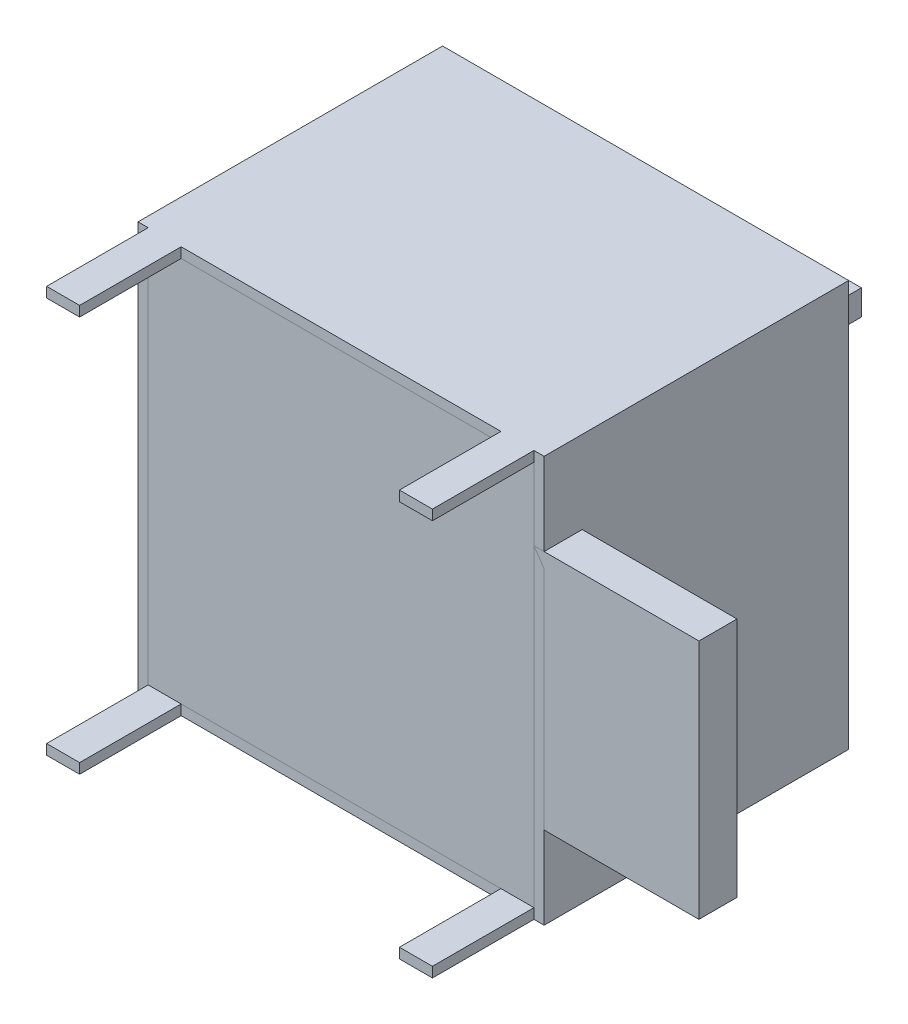
ISO-10303-21;
HEADER;
FILE_DESCRIPTION(('STEP AP214'),'2;1');
FILE_NAME('part.step','',(''),(''),'','','');
FILE_SCHEMA(('AUTOMOTIVE_DESIGN { 1 0 10303 214 1 1 1 1 }'));
ENDSEC;
DATA;
#1=APPLICATION_CONTEXT('core data for automotive mechanical design processes');
#2=APPLICATION_PROTOCOL_DEFINITION('international standard','automotive_design',2000,#1);
#3=PRODUCT_CONTEXT('',#1,'mechanical');
#4=PRODUCT('Part','Part','',(#3));
#5=PRODUCT_RELATED_PRODUCT_CATEGORY('part','',(#4));
#6=PRODUCT_DEFINITION_FORMATION('','',#4);
#7=PRODUCT_DEFINITION_CONTEXT('part definition',#1,'design');
#8=PRODUCT_DEFINITION('design','',#6,#7);
#9=PRODUCT_DEFINITION_SHAPE('','',#8);
#10=(LENGTH_UNIT() NAMED_UNIT(*) SI_UNIT(.MILLI.,.METRE.));
#11=(NAMED_UNIT(*) PLANE_ANGLE_UNIT() SI_UNIT($,.RADIAN.));
#12=(NAMED_UNIT(*) SI_UNIT($,.STERADIAN.) SOLID_ANGLE_UNIT());
#13=UNCERTAINTY_MEASURE_WITH_UNIT(LENGTH_MEASURE(1.E-05),#10,'distance_accuracy_value','');
#14=(GEOMETRIC_REPRESENTATION_CONTEXT(3) GLOBAL_UNCERTAINTY_ASSIGNED_CONTEXT((#13)) GLOBAL_UNIT_ASSIGNED_CONTEXT((#10,
#11,#12)) REPRESENTATION_CONTEXT('',''));
#15=CARTESIAN_POINT('',(0.,0.,0.));
#16=DIRECTION('',(0.,0.,1.));
#17=DIRECTION('',(1.,0.,0.));
#18=AXIS2_PLACEMENT_3D('',#15,#16,#17);
#19=CARTESIAN_POINT('',(0.4,15.6,10.5));
#20=DIRECTION('',(-1.,0.,0.));
#21=DIRECTION('',(0.,0.,1.));
#22=AXIS2_PLACEMENT_3D('',#19,#20,#21);
#23=PLANE('',#22);
#24=DIRECTION('',(0.,-1.,0.));
#25=VECTOR('',#24,1.);
#26=CARTESIAN_POINT('',(0.4,15.6,12.));
#27=LINE('',#26,#25);
#28=CARTESIAN_POINT('',(0.4,15.6,12.));
#29=VERTEX_POINT('',#28);
#30=CARTESIAN_POINT('',(0.4,0.399999999999999,12.));
#31=VERTEX_POINT('',#30);
#32=EDGE_CURVE('E141',#29,#31,#27,.T.);
#33=ORIENTED_EDGE('',*,*,#32,.F.);
#34=DIRECTION('',(0.,0.,1.));
#35=VECTOR('',#34,1.);
#36=CARTESIAN_POINT('',(0.4,15.6,10.5));
#37=LINE('',#36,#35);
#38=CARTESIAN_POINT('',(0.4,15.6,10.5));
#39=VERTEX_POINT('',#38);
#40=EDGE_CURVE('E12',#39,#29,#37,.T.);
#41=ORIENTED_EDGE('',*,*,#40,.F.);
#42=DIRECTION('',(0.,-1.,0.));
#43=VECTOR('',#42,1.);
#44=CARTESIAN_POINT('',(0.4,15.6,10.5));
#45=LINE('',#44,#43);
#46=CARTESIAN_POINT('',(0.4,0.399999999999999,10.5));
#47=VERTEX_POINT('',#46);
#48=EDGE_CURVE('E161',#39,#47,#45,.T.);
#49=ORIENTED_EDGE('',*,*,#48,.T.);
#50=DIRECTION('',(0.,0.,1.));
#51=VECTOR('',#50,1.);
#52=CARTESIAN_POINT('',(0.4,0.399999999999999,10.5));
#53=LINE('',#52,#51);
#54=EDGE_CURVE('E47',#47,#31,#53,.T.);
#55=ORIENTED_EDGE('',*,*,#54,.T.);
#56=EDGE_LOOP('',(#33,#41,#49,#55));
#57=FACE_BOUND('',#56,.T.);
#58=ADVANCED_FACE('F44',(#57),#23,.T.);
#59=CARTESIAN_POINT('',(0.4,15.6,10.5));
#60=DIRECTION('',(0.,1.,0.));
#61=DIRECTION('',(0.,0.,1.));
#62=AXIS2_PLACEMENT_3D('',#59,#60,#61);
#63=PLANE('',#62);
#64=DIRECTION('',(-1.,0.,0.));
#65=VECTOR('',#64,1.);
#66=CARTESIAN_POINT('',(0.4,15.6,12.));
#67=LINE('',#66,#65);
#68=CARTESIAN_POINT('',(15.6,15.6,12.));
#69=VERTEX_POINT('',#68);
#70=EDGE_CURVE('E159',#69,#29,#67,.T.);
#71=ORIENTED_EDGE('',*,*,#70,.F.);
#72=DIRECTION('',(0.,0.,1.));
#73=VECTOR('',#72,1.);
#74=CARTESIAN_POINT('',(15.6,15.6,10.5));
#75=LINE('',#74,#73);
#76=CARTESIAN_POINT('',(15.6,15.6,10.5));
#77=VERTEX_POINT('',#76);
#78=EDGE_CURVE('E53',#77,#69,#75,.T.);
#79=ORIENTED_EDGE('',*,*,#78,.F.);
#80=DIRECTION('',(-1.,0.,0.));
#81=VECTOR('',#80,1.);
#82=CARTESIAN_POINT('',(0.4,15.6,10.5));
#83=LINE('',#82,#81);
#84=EDGE_CURVE('E131',#77,#39,#83,.T.);
#85=ORIENTED_EDGE('',*,*,#84,.T.);
#86=ORIENTED_EDGE('',*,*,#40,.T.);
#87=EDGE_LOOP('',(#71,#79,#85,#86));
#88=FACE_BOUND('',#87,.T.);
#89=ADVANCED_FACE('F173',(#88),#63,.T.);
#90=CARTESIAN_POINT('',(15.6,15.6,10.5));
#91=DIRECTION('',(1.,0.,0.));
#92=DIRECTION('',(0.,1.,0.));
#93=AXIS2_PLACEMENT_3D('',#90,#91,#92);
#94=PLANE('',#93);
#95=DIRECTION('',(0.,1.,0.));
#96=VECTOR('',#95,1.);
#97=CARTESIAN_POINT('',(15.6,15.6,12.));
#98=LINE('',#97,#96);
#99=CARTESIAN_POINT('',(15.6,12.75,12.));
#100=VERTEX_POINT('',#99);
#101=EDGE_CURVE('E118',#100,#69,#98,.T.);
#102=ORIENTED_EDGE('',*,*,#101,.F.);
#103=DIRECTION('',(0.,0.,1.));
#104=VECTOR('',#103,1.);
#105=CARTESIAN_POINT('',(15.6,12.75,10.5));
#106=LINE('',#105,#104);
#107=CARTESIAN_POINT('',(15.6,12.75,10.5));
#108=VERTEX_POINT('',#107);
#109=EDGE_CURVE('E113',#108,#100,#106,.T.);
#110=ORIENTED_EDGE('',*,*,#109,.F.);
#111=DIRECTION('',(0.,1.,0.));
#112=VECTOR('',#111,1.);
#113=CARTESIAN_POINT('',(15.6,15.6,10.5));
#114=LINE('',#113,#112);
#115=EDGE_CURVE('E116',#108,#77,#114,.T.);
#116=ORIENTED_EDGE('',*,*,#115,.T.);
#117=ORIENTED_EDGE('',*,*,#78,.T.);
#118=EDGE_LOOP('',(#102,#110,#116,#117));
#119=FACE_BOUND('',#118,.T.);
#120=ADVANCED_FACE('F115',(#119),#94,.T.);
#121=CARTESIAN_POINT('',(15.6,12.75,10.5));
#122=DIRECTION('',(0.,1.,0.));
#123=DIRECTION('',(0.,0.,1.));
#124=AXIS2_PLACEMENT_3D('',#121,#122,#123);
#125=PLANE('',#124);
#126=DIRECTION('',(-1.,0.,0.));
#127=VECTOR('',#126,1.);
#128=CARTESIAN_POINT('',(15.6,12.75,12.));
#129=LINE('',#128,#127);
#130=CARTESIAN_POINT('',(22.1,12.75,12.));
#131=VERTEX_POINT('',#130);
#132=EDGE_CURVE('E156',#131,#100,#129,.T.);
#133=ORIENTED_EDGE('',*,*,#132,.F.);
#134=DIRECTION('',(0.,0.,1.));
#135=VECTOR('',#134,1.);
#136=CARTESIAN_POINT('',(22.1,12.75,10.5));
#137=LINE('',#136,#135);
#138=CARTESIAN_POINT('',(22.1,12.75,10.5));
#139=VERTEX_POINT('',#138);
#140=EDGE_CURVE('E123',#139,#131,#137,.T.);
#141=ORIENTED_EDGE('',*,*,#140,.F.);
#142=DIRECTION('',(-1.,0.,0.));
#143=VECTOR('',#142,1.);
#144=CARTESIAN_POINT('',(15.6,12.75,10.5));
#145=LINE('',#144,#143);
#146=EDGE_CURVE('E129',#139,#108,#145,.T.);
#147=ORIENTED_EDGE('',*,*,#146,.T.);
#148=ORIENTED_EDGE('',*,*,#109,.T.);
#149=EDGE_LOOP('',(#133,#141,#147,#148));
#150=FACE_BOUND('',#149,.T.);
#151=ADVANCED_FACE('F133',(#150),#125,.T.);
#152=CARTESIAN_POINT('',(22.1,12.75,10.5));
#153=DIRECTION('',(1.,0.,0.));
#154=DIRECTION('',(0.,0.,-1.));
#155=AXIS2_PLACEMENT_3D('',#152,#153,#154);
#156=PLANE('',#155);
#157=DIRECTION('',(0.,1.,0.));
#158=VECTOR('',#157,1.);
#159=CARTESIAN_POINT('',(22.1,12.75,12.));
#160=LINE('',#159,#158);
#161=CARTESIAN_POINT('',(22.1,3.25,12.));
#162=VERTEX_POINT('',#161);
#163=EDGE_CURVE('E153',#162,#131,#160,.T.);
#164=ORIENTED_EDGE('',*,*,#163,.F.);
#165=DIRECTION('',(0.,0.,1.));
#166=VECTOR('',#165,1.);
#167=CARTESIAN_POINT('',(22.1,3.25,10.5));
#168=LINE('',#167,#166);
#169=CARTESIAN_POINT('',(22.1,3.25,10.5));
#170=VERTEX_POINT('',#169);
#171=EDGE_CURVE('E165',#170,#162,#168,.T.);
#172=ORIENTED_EDGE('',*,*,#171,.F.);
#173=DIRECTION('',(0.,1.,0.));
#174=VECTOR('',#173,1.);
#175=CARTESIAN_POINT('',(22.1,12.75,10.5));
#176=LINE('',#175,#174);
#177=EDGE_CURVE('E134',#170,#139,#176,.T.);
#178=ORIENTED_EDGE('',*,*,#177,.T.);
#179=ORIENTED_EDGE('',*,*,#140,.T.);
#180=EDGE_LOOP('',(#164,#172,#178,#179));
#181=FACE_BOUND('',#180,.T.);
#182=ADVANCED_FACE('F186',(#181),#156,.T.);
#183=CARTESIAN_POINT('',(15.6,3.25,10.5));
#184=DIRECTION('',(0.,-1.,0.));
#185=DIRECTION('',(0.,0.,-1.));
#186=AXIS2_PLACEMENT_3D('',#183,#184,#185);
#187=PLANE('',#186);
#188=DIRECTION('',(1.,0.,0.));
#189=VECTOR('',#188,1.);
#190=CARTESIAN_POINT('',(15.6,3.25,12.));
#191=LINE('',#190,#189);
#192=CARTESIAN_POINT('',(15.6,3.25,12.));
#193=VERTEX_POINT('',#192);
#194=EDGE_CURVE('E150',#193,#162,#191,.T.);
#195=ORIENTED_EDGE('',*,*,#194,.F.);
#196=DIRECTION('',(0.,0.,1.));
#197=VECTOR('',#196,1.);
#198=CARTESIAN_POINT('',(15.6,3.25,10.5));
#199=LINE('',#198,#197);
#200=CARTESIAN_POINT('',(15.6,3.25,10.5));
#201=VERTEX_POINT('',#200);
#202=EDGE_CURVE('E167',#201,#193,#199,.T.);
#203=ORIENTED_EDGE('',*,*,#202,.F.);
#204=DIRECTION('',(1.,0.,0.));
#205=VECTOR('',#204,1.);
#206=CARTESIAN_POINT('',(15.6,3.25,10.5));
#207=LINE('',#206,#205);
#208=EDGE_CURVE('E136',#201,#170,#207,.T.);
#209=ORIENTED_EDGE('',*,*,#208,.T.);
#210=ORIENTED_EDGE('',*,*,#171,.T.);
#211=EDGE_LOOP('',(#195,#203,#209,#210));
#212=FACE_BOUND('',#211,.T.);
#213=ADVANCED_FACE('F189',(#212),#187,.T.);
#214=CARTESIAN_POINT('',(15.6,3.25,10.5));
#215=DIRECTION('',(1.,0.,0.));
#216=DIRECTION('',(0.,1.,0.));
#217=AXIS2_PLACEMENT_3D('',#214,#215,#216);
#218=PLANE('',#217);
#219=DIRECTION('',(0.,1.,0.));
#220=VECTOR('',#219,1.);
#221=CARTESIAN_POINT('',(15.6,3.25,12.));
#222=LINE('',#221,#220);
#223=CARTESIAN_POINT('',(15.6,0.399999999999999,12.));
#224=VERTEX_POINT('',#223);
#225=EDGE_CURVE('E147',#224,#193,#222,.T.);
#226=ORIENTED_EDGE('',*,*,#225,.F.);
#227=DIRECTION('',(0.,0.,1.));
#228=VECTOR('',#227,1.);
#229=CARTESIAN_POINT('',(15.6,0.399999999999999,10.5));
#230=LINE('',#229,#228);
#231=CARTESIAN_POINT('',(15.6,0.399999999999999,10.5));
#232=VERTEX_POINT('',#231);
#233=EDGE_CURVE('E168',#232,#224,#230,.T.);
#234=ORIENTED_EDGE('',*,*,#233,.F.);
#235=DIRECTION('',(0.,1.,0.));
#236=VECTOR('',#235,1.);
#237=CARTESIAN_POINT('',(15.6,3.25,10.5));
#238=LINE('',#237,#236);
#239=EDGE_CURVE('E264',#232,#201,#238,.T.);
#240=ORIENTED_EDGE('',*,*,#239,.T.);
#241=ORIENTED_EDGE('',*,*,#202,.T.);
#242=EDGE_LOOP('',(#226,#234,#240,#241));
#243=FACE_BOUND('',#242,.T.);
#244=ADVANCED_FACE('F193',(#243),#218,.T.);
#245=CARTESIAN_POINT('',(0.4,0.399999999999999,10.5));
#246=DIRECTION('',(0.,-1.,0.));
#247=DIRECTION('',(0.,0.,-1.));
#248=AXIS2_PLACEMENT_3D('',#245,#246,#247);
#249=PLANE('',#248);
#250=DIRECTION('',(1.,0.,0.));
#251=VECTOR('',#250,1.);
#252=CARTESIAN_POINT('',(0.4,0.399999999999999,12.));
#253=LINE('',#252,#251);
#254=EDGE_CURVE('E144',#31,#224,#253,.T.);
#255=ORIENTED_EDGE('',*,*,#254,.F.);
#256=ORIENTED_EDGE('',*,*,#54,.F.);
#257=DIRECTION('',(1.,0.,0.));
#258=VECTOR('',#257,1.);
#259=CARTESIAN_POINT('',(0.4,0.399999999999999,10.5));
#260=LINE('',#259,#258);
#261=EDGE_CURVE('E265',#47,#232,#260,.T.);
#262=ORIENTED_EDGE('',*,*,#261,.T.);
#263=ORIENTED_EDGE('',*,*,#233,.T.);
#264=EDGE_LOOP('',(#255,#256,#262,#263));
#265=FACE_BOUND('',#264,.T.);
#266=ADVANCED_FACE('F170',(#265),#249,.T.);
#267=CARTESIAN_POINT('',(0.,0.,10.5));
#268=DIRECTION('',(0.,0.,1.));
#269=DIRECTION('',(1.,0.,0.));
#270=AXIS2_PLACEMENT_3D('',#267,#268,#269);
#271=PLANE('',#270);
#272=ORIENTED_EDGE('',*,*,#48,.F.);
#273=ORIENTED_EDGE('',*,*,#84,.F.);
#274=ORIENTED_EDGE('',*,*,#115,.F.);
#275=ORIENTED_EDGE('',*,*,#146,.F.);
#276=ORIENTED_EDGE('',*,*,#177,.F.);
#277=ORIENTED_EDGE('',*,*,#208,.F.);
#278=ORIENTED_EDGE('',*,*,#239,.F.);
#279=ORIENTED_EDGE('',*,*,#261,.F.);
#280=EDGE_LOOP('',(#272,#273,#274,#275,#276,#277,#278,#279));
#281=FACE_BOUND('',#280,.T.);
#282=ADVANCED_FACE('F127',(#281),#271,.F.);
#283=CARTESIAN_POINT('',(0.,0.,12.));
#284=DIRECTION('',(0.,0.,1.));
#285=DIRECTION('',(1.,0.,0.));
#286=AXIS2_PLACEMENT_3D('',#283,#284,#285);
#287=PLANE('',#286);
#288=ORIENTED_EDGE('',*,*,#32,.T.);
#289=ORIENTED_EDGE('',*,*,#254,.T.);
#290=ORIENTED_EDGE('',*,*,#225,.T.);
#291=ORIENTED_EDGE('',*,*,#194,.T.);
#292=ORIENTED_EDGE('',*,*,#163,.T.);
#293=ORIENTED_EDGE('',*,*,#132,.T.);
#294=ORIENTED_EDGE('',*,*,#101,.T.);
#295=ORIENTED_EDGE('',*,*,#70,.T.);
#296=EDGE_LOOP('',(#288,#289,#290,#291,#292,#293,#294,#295));
#297=FACE_BOUND('',#296,.T.);
#298=ADVANCED_FACE('F172',(#297),#287,.T.);
#299=CLOSED_SHELL('',(#58,#89,#120,#151,#182,#213,#244,#266,#282,#298));
#300=MANIFOLD_SOLID_BREP('B2',#299);
#301=CARTESIAN_POINT('',(0.,0.,0.));
#302=DIRECTION('',(0.,0.,-1.));
#303=DIRECTION('',(-1.,0.,0.));
#304=AXIS2_PLACEMENT_3D('',#301,#302,#303);
#305=PLANE('',#304);
#306=DIRECTION('',(0.,-1.,0.));
#307=VECTOR('',#306,1.);
#308=CARTESIAN_POINT('',(0.,0.,0.));
#309=LINE('',#308,#307);
#310=CARTESIAN_POINT('',(0.,16.,0.));
#311=VERTEX_POINT('',#310);
#312=CARTESIAN_POINT('',(0.,0.,0.));
#313=VERTEX_POINT('',#312);
#314=EDGE_CURVE('E611',#311,#313,#309,.T.);
#315=ORIENTED_EDGE('',*,*,#314,.F.);
#316=DIRECTION('',(-1.,0.,0.));
#317=VECTOR('',#316,1.);
#318=CARTESIAN_POINT('',(0.,16.,0.));
#319=LINE('',#318,#317);
#320=CARTESIAN_POINT('',(16.,16.,0.));
#321=VERTEX_POINT('',#320);
#322=EDGE_CURVE('E603',#321,#311,#319,.T.);
#323=ORIENTED_EDGE('',*,*,#322,.F.);
#324=DIRECTION('',(0.,1.,0.));
#325=VECTOR('',#324,1.);
#326=CARTESIAN_POINT('',(16.,0.,0.));
#327=LINE('',#326,#325);
#328=CARTESIAN_POINT('',(16.,0.,0.));
#329=VERTEX_POINT('',#328);
#330=EDGE_CURVE('E627',#329,#321,#327,.T.);
#331=ORIENTED_EDGE('',*,*,#330,.F.);
#332=DIRECTION('',(1.,0.,0.));
#333=VECTOR('',#332,1.);
#334=CARTESIAN_POINT('',(0.,0.,0.));
#335=LINE('',#334,#333);
#336=EDGE_CURVE('E628',#313,#329,#335,.T.);
#337=ORIENTED_EDGE('',*,*,#336,.F.);
#338=EDGE_LOOP('',(#315,#323,#331,#337));
#339=FACE_BOUND('',#338,.T.);
#340=DIRECTION('',(1.,0.,0.));
#341=VECTOR('',#340,1.);
#342=CARTESIAN_POINT('',(9.,8.5,0.));
#343=LINE('',#342,#341);
#344=CARTESIAN_POINT('',(7.,8.5,0.));
#345=VERTEX_POINT('',#344);
#346=CARTESIAN_POINT('',(9.,8.5,0.));
#347=VERTEX_POINT('',#346);
#348=EDGE_CURVE('E1030',#345,#347,#343,.T.);
#349=ORIENTED_EDGE('',*,*,#348,.F.);
#350=DIRECTION('',(0.,1.,0.));
#351=VECTOR('',#350,1.);
#352=CARTESIAN_POINT('',(7.,8.5,0.));
#353=LINE('',#352,#351);
#354=CARTESIAN_POINT('',(7.,7.5,0.));
#355=VERTEX_POINT('',#354);
#356=EDGE_CURVE('E470',#355,#345,#353,.T.);
#357=ORIENTED_EDGE('',*,*,#356,.F.);
#358=DIRECTION('',(-1.,0.,0.));
#359=VECTOR('',#358,1.);
#360=CARTESIAN_POINT('',(9.,7.5,0.));
#361=LINE('',#360,#359);
#362=CARTESIAN_POINT('',(9.,7.5,0.));
#363=VERTEX_POINT('',#362);
#364=EDGE_CURVE('E466',#363,#355,#361,.T.);
#365=ORIENTED_EDGE('',*,*,#364,.F.);
#366=DIRECTION('',(0.,-1.,0.));
#367=VECTOR('',#366,1.);
#368=CARTESIAN_POINT('',(9.,8.5,0.));
#369=LINE('',#368,#367);
#370=EDGE_CURVE('E1027',#347,#363,#369,.T.);
#371=ORIENTED_EDGE('',*,*,#370,.F.);
#372=EDGE_LOOP('',(#349,#357,#365,#371));
#373=FACE_BOUND('',#372,.T.);
#374=ADVANCED_FACE('F271',(#339,#373),#305,.T.);
#375=CARTESIAN_POINT('',(0.,0.,12.));
#376=DIRECTION('',(0.,0.,-1.));
#377=DIRECTION('',(-1.,0.,0.));
#378=AXIS2_PLACEMENT_3D('',#375,#376,#377);
#379=PLANE('',#378);
#380=DIRECTION('',(1.,0.,0.));
#381=VECTOR('',#380,1.);
#382=CARTESIAN_POINT('',(0.,0.,12.));
#383=LINE('',#382,#381);
#384=CARTESIAN_POINT('',(0.,0.,12.));
#385=VERTEX_POINT('',#384);
#386=CARTESIAN_POINT('',(0.4,0.,12.));
#387=VERTEX_POINT('',#386);
#388=EDGE_CURVE('E604',#385,#387,#383,.T.);
#389=ORIENTED_EDGE('',*,*,#388,.T.);
#390=DIRECTION('',(0.,1.,0.));
#391=VECTOR('',#390,1.);
#392=CARTESIAN_POINT('',(0.4,0.399999999999999,12.));
#393=LINE('',#392,#391);
#394=CARTESIAN_POINT('',(0.4,0.399999999999999,12.));
#395=VERTEX_POINT('',#394);
#396=EDGE_CURVE('E472',#387,#395,#393,.T.);
#397=ORIENTED_EDGE('',*,*,#396,.T.);
#398=DIRECTION('',(0.,-1.,0.));
#399=VECTOR('',#398,1.);
#400=CARTESIAN_POINT('',(0.4,0.,12.));
#401=LINE('',#400,#399);
#402=CARTESIAN_POINT('',(0.4,15.6,12.));
#403=VERTEX_POINT('',#402);
#404=EDGE_CURVE('E659',#403,#395,#401,.T.);
#405=ORIENTED_EDGE('',*,*,#404,.F.);
#406=DIRECTION('',(0.,-1.,0.));
#407=VECTOR('',#406,1.);
#408=CARTESIAN_POINT('',(0.4,15.6,12.));
#409=LINE('',#408,#407);
#410=CARTESIAN_POINT('',(0.4,16.,12.));
#411=VERTEX_POINT('',#410);
#412=EDGE_CURVE('E552',#411,#403,#409,.T.);
#413=ORIENTED_EDGE('',*,*,#412,.F.);
#414=DIRECTION('',(-1.,0.,0.));
#415=VECTOR('',#414,1.);
#416=CARTESIAN_POINT('',(0.,16.,12.));
#417=LINE('',#416,#415);
#418=CARTESIAN_POINT('',(0.,16.,12.));
#419=VERTEX_POINT('',#418);
#420=EDGE_CURVE('E572',#411,#419,#417,.T.);
#421=ORIENTED_EDGE('',*,*,#420,.T.);
#422=DIRECTION('',(0.,-1.,0.));
#423=VECTOR('',#422,1.);
#424=CARTESIAN_POINT('',(0.,0.,12.));
#425=LINE('',#424,#423);
#426=EDGE_CURVE('E599',#419,#385,#425,.T.);
#427=ORIENTED_EDGE('',*,*,#426,.T.);
#428=EDGE_LOOP('',(#389,#397,#405,#413,#421,#427));
#429=FACE_BOUND('',#428,.T.);
#430=ADVANCED_FACE('F715',(#429),#379,.F.);
#431=DIRECTION('',(0.,1.,0.));
#432=VECTOR('',#431,1.);
#433=CARTESIAN_POINT('',(15.6,0.399999999999999,12.));
#434=LINE('',#433,#432);
#435=CARTESIAN_POINT('',(15.6,0.,12.));
#436=VERTEX_POINT('',#435);
#437=CARTESIAN_POINT('',(15.6,0.4,12.));
#438=VERTEX_POINT('',#437);
#439=EDGE_CURVE('E500',#436,#438,#434,.T.);
#440=ORIENTED_EDGE('',*,*,#439,.F.);
#441=CARTESIAN_POINT('',(16.,0.,12.));
#442=VERTEX_POINT('',#441);
#443=EDGE_CURVE('E602',#436,#442,#383,.T.);
#444=ORIENTED_EDGE('',*,*,#443,.T.);
#445=DIRECTION('',(0.,1.,0.));
#446=VECTOR('',#445,1.);
#447=CARTESIAN_POINT('',(16.,0.,12.));
#448=LINE('',#447,#446);
#449=CARTESIAN_POINT('',(16.,16.,12.));
#450=VERTEX_POINT('',#449);
#451=EDGE_CURVE('E607',#442,#450,#448,.T.);
#452=ORIENTED_EDGE('',*,*,#451,.T.);
#453=CARTESIAN_POINT('',(15.6,16.,12.));
#454=VERTEX_POINT('',#453);
#455=EDGE_CURVE('E615',#450,#454,#417,.T.);
#456=ORIENTED_EDGE('',*,*,#455,.T.);
#457=DIRECTION('',(0.,-1.,0.));
#458=VECTOR('',#457,1.);
#459=CARTESIAN_POINT('',(15.6,15.6,12.));
#460=LINE('',#459,#458);
#461=CARTESIAN_POINT('',(15.6,15.6,12.));
#462=VERTEX_POINT('',#461);
#463=EDGE_CURVE('E525',#454,#462,#460,.T.);
#464=ORIENTED_EDGE('',*,*,#463,.T.);
#465=DIRECTION('',(0.,1.,0.));
#466=VECTOR('',#465,1.);
#467=CARTESIAN_POINT('',(15.6,0.,12.));
#468=LINE('',#467,#466);
#469=EDGE_CURVE('E594',#438,#462,#468,.T.);
#470=ORIENTED_EDGE('',*,*,#469,.F.);
#471=EDGE_LOOP('',(#440,#444,#452,#456,#464,#470));
#472=FACE_BOUND('',#471,.T.);
#473=ADVANCED_FACE('F674',(#472),#379,.F.);
#474=DIRECTION('',(1.,0.,0.));
#475=VECTOR('',#474,1.);
#476=CARTESIAN_POINT('',(0.,0.4,12.));
#477=LINE('',#476,#475);
#478=CARTESIAN_POINT('',(1.7,0.4,12.));
#479=VERTEX_POINT('',#478);
#480=CARTESIAN_POINT('',(14.3,0.399999999999999,12.));
#481=VERTEX_POINT('',#480);
#482=EDGE_CURVE('E660',#479,#481,#477,.T.);
#483=ORIENTED_EDGE('',*,*,#482,.F.);
#484=DIRECTION('',(0.,-1.,0.));
#485=VECTOR('',#484,1.);
#486=CARTESIAN_POINT('',(1.7,0.399999999999999,12.));
#487=LINE('',#486,#485);
#488=CARTESIAN_POINT('',(1.7,0.,12.));
#489=VERTEX_POINT('',#488);
#490=EDGE_CURVE('E297',#479,#489,#487,.T.);
#491=ORIENTED_EDGE('',*,*,#490,.T.);
#492=CARTESIAN_POINT('',(14.3,0.,12.));
#493=VERTEX_POINT('',#492);
#494=EDGE_CURVE('E608',#489,#493,#383,.T.);
#495=ORIENTED_EDGE('',*,*,#494,.T.);
#496=DIRECTION('',(0.,-1.,0.));
#497=VECTOR('',#496,1.);
#498=CARTESIAN_POINT('',(14.3,0.399999999999999,12.));
#499=LINE('',#498,#497);
#500=EDGE_CURVE('E505',#481,#493,#499,.T.);
#501=ORIENTED_EDGE('',*,*,#500,.F.);
#502=EDGE_LOOP('',(#483,#491,#495,#501));
#503=FACE_BOUND('',#502,.T.);
#504=ADVANCED_FACE('F696',(#503),#379,.F.);
#505=DIRECTION('',(-1.,0.,0.));
#506=VECTOR('',#505,1.);
#507=CARTESIAN_POINT('',(0.,15.6,12.));
#508=LINE('',#507,#506);
#509=CARTESIAN_POINT('',(14.3,15.6,12.));
#510=VERTEX_POINT('',#509);
#511=CARTESIAN_POINT('',(1.7,15.6,12.));
#512=VERTEX_POINT('',#511);
#513=EDGE_CURVE('E591',#510,#512,#508,.T.);
#514=ORIENTED_EDGE('',*,*,#513,.F.);
#515=DIRECTION('',(0.,1.,0.));
#516=VECTOR('',#515,1.);
#517=CARTESIAN_POINT('',(14.3,15.6,12.));
#518=LINE('',#517,#516);
#519=CARTESIAN_POINT('',(14.3,16.,12.));
#520=VERTEX_POINT('',#519);
#521=EDGE_CURVE('E530',#510,#520,#518,.T.);
#522=ORIENTED_EDGE('',*,*,#521,.T.);
#523=CARTESIAN_POINT('',(1.7,16.,12.));
#524=VERTEX_POINT('',#523);
#525=EDGE_CURVE('E275',#520,#524,#417,.T.);
#526=ORIENTED_EDGE('',*,*,#525,.T.);
#527=DIRECTION('',(0.,1.,0.));
#528=VECTOR('',#527,1.);
#529=CARTESIAN_POINT('',(1.7,15.6,12.));
#530=LINE('',#529,#528);
#531=EDGE_CURVE('E557',#512,#524,#530,.T.);
#532=ORIENTED_EDGE('',*,*,#531,.F.);
#533=EDGE_LOOP('',(#514,#522,#526,#532));
#534=FACE_BOUND('',#533,.T.);
#535=ADVANCED_FACE('F723',(#534),#379,.F.);
#536=CARTESIAN_POINT('',(0.,0.,12.));
#537=DIRECTION('',(1.,0.,0.));
#538=DIRECTION('',(0.,0.,-1.));
#539=AXIS2_PLACEMENT_3D('',#536,#537,#538);
#540=PLANE('',#539);
#541=ORIENTED_EDGE('',*,*,#314,.T.);
#542=DIRECTION('',(0.,0.,-1.));
#543=VECTOR('',#542,1.);
#544=CARTESIAN_POINT('',(0.,0.,12.));
#545=LINE('',#544,#543);
#546=EDGE_CURVE('E42',#385,#313,#545,.T.);
#547=ORIENTED_EDGE('',*,*,#546,.F.);
#548=ORIENTED_EDGE('',*,*,#426,.F.);
#549=DIRECTION('',(0.,0.,-1.));
#550=VECTOR('',#549,1.);
#551=CARTESIAN_POINT('',(0.,16.,12.));
#552=LINE('',#551,#550);
#553=EDGE_CURVE('E617',#419,#311,#552,.T.);
#554=ORIENTED_EDGE('',*,*,#553,.T.);
#555=EDGE_LOOP('',(#541,#547,#548,#554));
#556=FACE_BOUND('',#555,.T.);
#557=ADVANCED_FACE('F273',(#556),#540,.F.);
#558=CARTESIAN_POINT('',(0.,0.,12.));
#559=DIRECTION('',(0.,1.,0.));
#560=DIRECTION('',(0.,0.,1.));
#561=AXIS2_PLACEMENT_3D('',#558,#559,#560);
#562=PLANE('',#561);
#563=ORIENTED_EDGE('',*,*,#336,.T.);
#564=DIRECTION('',(0.,0.,-1.));
#565=VECTOR('',#564,1.);
#566=CARTESIAN_POINT('',(16.,0.,12.));
#567=LINE('',#566,#565);
#568=EDGE_CURVE('E281',#442,#329,#567,.T.);
#569=ORIENTED_EDGE('',*,*,#568,.F.);
#570=ORIENTED_EDGE('',*,*,#443,.F.);
#571=DIRECTION('',(0.,0.,-1.));
#572=VECTOR('',#571,1.);
#573=CARTESIAN_POINT('',(15.6,0.,16.));
#574=LINE('',#573,#572);
#575=CARTESIAN_POINT('',(15.6,0.,16.));
#576=VERTEX_POINT('',#575);
#577=EDGE_CURVE('E511',#576,#436,#574,.T.);
#578=ORIENTED_EDGE('',*,*,#577,.F.);
#579=DIRECTION('',(1.,0.,0.));
#580=VECTOR('',#579,1.);
#581=CARTESIAN_POINT('',(15.6,0.,16.));
#582=LINE('',#581,#580);
#583=CARTESIAN_POINT('',(14.3,0.,16.));
#584=VERTEX_POINT('',#583);
#585=EDGE_CURVE('E509',#584,#576,#582,.T.);
#586=ORIENTED_EDGE('',*,*,#585,.F.);
#587=DIRECTION('',(0.,0.,-1.));
#588=VECTOR('',#587,1.);
#589=CARTESIAN_POINT('',(14.3,0.,16.));
#590=LINE('',#589,#588);
#591=EDGE_CURVE('E516',#584,#493,#590,.T.);
#592=ORIENTED_EDGE('',*,*,#591,.T.);
#593=ORIENTED_EDGE('',*,*,#494,.F.);
#594=DIRECTION('',(0.,0.,-1.));
#595=VECTOR('',#594,1.);
#596=CARTESIAN_POINT('',(1.7,0.,16.));
#597=LINE('',#596,#595);
#598=CARTESIAN_POINT('',(1.7,0.,16.));
#599=VERTEX_POINT('',#598);
#600=EDGE_CURVE('E496',#599,#489,#597,.T.);
#601=ORIENTED_EDGE('',*,*,#600,.F.);
#602=DIRECTION('',(-1.,0.,0.));
#603=VECTOR('',#602,1.);
#604=CARTESIAN_POINT('',(0.4,0.,16.));
#605=LINE('',#604,#603);
#606=CARTESIAN_POINT('',(0.4,0.,16.));
#607=VERTEX_POINT('',#606);
#608=EDGE_CURVE('E482',#599,#607,#605,.T.);
#609=ORIENTED_EDGE('',*,*,#608,.T.);
#610=DIRECTION('',(0.,0.,-1.));
#611=VECTOR('',#610,1.);
#612=CARTESIAN_POINT('',(0.4,0.,16.));
#613=LINE('',#612,#611);
#614=EDGE_CURVE('E498',#607,#387,#613,.T.);
#615=ORIENTED_EDGE('',*,*,#614,.T.);
#616=ORIENTED_EDGE('',*,*,#388,.F.);
#617=ORIENTED_EDGE('',*,*,#546,.T.);
#618=EDGE_LOOP('',(#563,#569,#570,#578,#586,#592,#593,#601,#609,#615,#616,#617));
#619=FACE_BOUND('',#618,.T.);
#620=ADVANCED_FACE('F691',(#619),#562,.F.);
#621=CARTESIAN_POINT('',(16.,0.,12.));
#622=DIRECTION('',(-1.,0.,0.));
#623=DIRECTION('',(0.,0.,1.));
#624=AXIS2_PLACEMENT_3D('',#621,#622,#623);
#625=PLANE('',#624);
#626=ORIENTED_EDGE('',*,*,#330,.T.);
#627=DIRECTION('',(0.,0.,-1.));
#628=VECTOR('',#627,1.);
#629=CARTESIAN_POINT('',(16.,16.,12.));
#630=LINE('',#629,#628);
#631=EDGE_CURVE('E621',#450,#321,#630,.T.);
#632=ORIENTED_EDGE('',*,*,#631,.F.);
#633=ORIENTED_EDGE('',*,*,#451,.F.);
#634=ORIENTED_EDGE('',*,*,#568,.T.);
#635=EDGE_LOOP('',(#626,#632,#633,#634));
#636=FACE_BOUND('',#635,.T.);
#637=ADVANCED_FACE('F731',(#636),#625,.F.);
#638=CARTESIAN_POINT('',(0.,16.,12.));
#639=DIRECTION('',(0.,-1.,0.));
#640=DIRECTION('',(0.,0.,-1.));
#641=AXIS2_PLACEMENT_3D('',#638,#639,#640);
#642=PLANE('',#641);
#643=ORIENTED_EDGE('',*,*,#322,.T.);
#644=ORIENTED_EDGE('',*,*,#553,.F.);
#645=ORIENTED_EDGE('',*,*,#420,.F.);
#646=DIRECTION('',(0.,0.,-1.));
#647=VECTOR('',#646,1.);
#648=CARTESIAN_POINT('',(0.4,16.,16.));
#649=LINE('',#648,#647);
#650=CARTESIAN_POINT('',(0.4,16.,16.));
#651=VERTEX_POINT('',#650);
#652=EDGE_CURVE('E563',#651,#411,#649,.T.);
#653=ORIENTED_EDGE('',*,*,#652,.F.);
#654=DIRECTION('',(-1.,0.,0.));
#655=VECTOR('',#654,1.);
#656=CARTESIAN_POINT('',(0.4,16.,16.));
#657=LINE('',#656,#655);
#658=CARTESIAN_POINT('',(1.7,16.,16.));
#659=VERTEX_POINT('',#658);
#660=EDGE_CURVE('E561',#659,#651,#657,.T.);
#661=ORIENTED_EDGE('',*,*,#660,.F.);
#662=DIRECTION('',(0.,0.,-1.));
#663=VECTOR('',#662,1.);
#664=CARTESIAN_POINT('',(1.7,16.,16.));
#665=LINE('',#664,#663);
#666=EDGE_CURVE('E574',#659,#524,#665,.T.);
#667=ORIENTED_EDGE('',*,*,#666,.T.);
#668=ORIENTED_EDGE('',*,*,#525,.F.);
#669=DIRECTION('',(0.,0.,-1.));
#670=VECTOR('',#669,1.);
#671=CARTESIAN_POINT('',(14.3,16.,16.));
#672=LINE('',#671,#670);
#673=CARTESIAN_POINT('',(14.3,16.,16.));
#674=VERTEX_POINT('',#673);
#675=EDGE_CURVE('E548',#674,#520,#672,.T.);
#676=ORIENTED_EDGE('',*,*,#675,.F.);
#677=DIRECTION('',(1.,0.,0.));
#678=VECTOR('',#677,1.);
#679=CARTESIAN_POINT('',(15.6,16.,16.));
#680=LINE('',#679,#678);
#681=CARTESIAN_POINT('',(15.6,16.,16.));
#682=VERTEX_POINT('',#681);
#683=EDGE_CURVE('E529',#674,#682,#680,.T.);
#684=ORIENTED_EDGE('',*,*,#683,.T.);
#685=DIRECTION('',(0.,0.,-1.));
#686=VECTOR('',#685,1.);
#687=CARTESIAN_POINT('',(15.6,16.,16.));
#688=LINE('',#687,#686);
#689=EDGE_CURVE('E550',#682,#454,#688,.T.);
#690=ORIENTED_EDGE('',*,*,#689,.T.);
#691=ORIENTED_EDGE('',*,*,#455,.F.);
#692=ORIENTED_EDGE('',*,*,#631,.T.);
#693=EDGE_LOOP('',(#643,#644,#645,#653,#661,#667,#668,#676,#684,#690,#691,#692));
#694=FACE_BOUND('',#693,.T.);
#695=ADVANCED_FACE('F727',(#694),#642,.F.);
#696=CARTESIAN_POINT('',(0.4,0.,12.));
#697=DIRECTION('',(1.,0.,0.));
#698=DIRECTION('',(0.,0.,-1.));
#699=AXIS2_PLACEMENT_3D('',#696,#697,#698);
#700=PLANE('',#699);
#701=DIRECTION('',(0.,-1.,0.));
#702=VECTOR('',#701,1.);
#703=CARTESIAN_POINT('',(0.4,0.,0.4));
#704=LINE('',#703,#702);
#705=CARTESIAN_POINT('',(0.4,15.6,0.4));
#706=VERTEX_POINT('',#705);
#707=CARTESIAN_POINT('',(0.4,0.4,0.4));
#708=VERTEX_POINT('',#707);
#709=EDGE_CURVE('E648',#706,#708,#704,.T.);
#710=ORIENTED_EDGE('',*,*,#709,.F.);
#711=DIRECTION('',(0.,0.,-1.));
#712=VECTOR('',#711,1.);
#713=CARTESIAN_POINT('',(0.4,15.6,12.));
#714=LINE('',#713,#712);
#715=EDGE_CURVE('E593',#403,#706,#714,.T.);
#716=ORIENTED_EDGE('',*,*,#715,.F.);
#717=ORIENTED_EDGE('',*,*,#404,.T.);
#718=DIRECTION('',(0.,0.,-1.));
#719=VECTOR('',#718,1.);
#720=CARTESIAN_POINT('',(0.4,0.4,12.));
#721=LINE('',#720,#719);
#722=EDGE_CURVE('E632',#395,#708,#721,.T.);
#723=ORIENTED_EDGE('',*,*,#722,.T.);
#724=EDGE_LOOP('',(#710,#716,#717,#723));
#725=FACE_BOUND('',#724,.T.);
#726=ADVANCED_FACE('F730',(#725),#700,.T.);
#727=CARTESIAN_POINT('',(0.,0.4,12.));
#728=DIRECTION('',(0.,1.,0.));
#729=DIRECTION('',(0.,0.,1.));
#730=AXIS2_PLACEMENT_3D('',#727,#728,#729);
#731=PLANE('',#730);
#732=DIRECTION('',(1.,0.,0.));
#733=VECTOR('',#732,1.);
#734=CARTESIAN_POINT('',(0.,0.4,0.4));
#735=LINE('',#734,#733);
#736=CARTESIAN_POINT('',(15.6,0.4,0.4));
#737=VERTEX_POINT('',#736);
#738=EDGE_CURVE('E651',#708,#737,#735,.T.);
#739=ORIENTED_EDGE('',*,*,#738,.F.);
#740=ORIENTED_EDGE('',*,*,#722,.F.);
#741=DIRECTION('',(0.,0.,-1.));
#742=VECTOR('',#741,1.);
#743=CARTESIAN_POINT('',(0.4,0.399999999999999,16.));
#744=LINE('',#743,#742);
#745=CARTESIAN_POINT('',(0.4,0.399999999999999,16.));
#746=VERTEX_POINT('',#745);
#747=EDGE_CURVE('E490',#746,#395,#744,.T.);
#748=ORIENTED_EDGE('',*,*,#747,.F.);
#749=DIRECTION('',(1.,0.,0.));
#750=VECTOR('',#749,1.);
#751=CARTESIAN_POINT('',(0.4,0.399999999999999,16.));
#752=LINE('',#751,#750);
#753=CARTESIAN_POINT('',(1.7,0.399999999999999,16.));
#754=VERTEX_POINT('',#753);
#755=EDGE_CURVE('E488',#746,#754,#752,.T.);
#756=ORIENTED_EDGE('',*,*,#755,.T.);
#757=DIRECTION('',(0.,0.,-1.));
#758=VECTOR('',#757,1.);
#759=CARTESIAN_POINT('',(1.7,0.399999999999999,16.));
#760=LINE('',#759,#758);
#761=EDGE_CURVE('E494',#754,#479,#760,.T.);
#762=ORIENTED_EDGE('',*,*,#761,.T.);
#763=ORIENTED_EDGE('',*,*,#482,.T.);
#764=DIRECTION('',(0.,0.,-1.));
#765=VECTOR('',#764,1.);
#766=CARTESIAN_POINT('',(14.3,0.399999999999999,16.));
#767=LINE('',#766,#765);
#768=CARTESIAN_POINT('',(14.3,0.399999999999999,16.));
#769=VERTEX_POINT('',#768);
#770=EDGE_CURVE('E519',#769,#481,#767,.T.);
#771=ORIENTED_EDGE('',*,*,#770,.F.);
#772=DIRECTION('',(-1.,0.,0.));
#773=VECTOR('',#772,1.);
#774=CARTESIAN_POINT('',(15.6,0.399999999999999,16.));
#775=LINE('',#774,#773);
#776=CARTESIAN_POINT('',(15.6,0.399999999999999,16.));
#777=VERTEX_POINT('',#776);
#778=EDGE_CURVE('E504',#777,#769,#775,.T.);
#779=ORIENTED_EDGE('',*,*,#778,.F.);
#780=DIRECTION('',(0.,0.,-1.));
#781=VECTOR('',#780,1.);
#782=CARTESIAN_POINT('',(15.6,0.399999999999999,16.));
#783=LINE('',#782,#781);
#784=EDGE_CURVE('E522',#777,#438,#783,.T.);
#785=ORIENTED_EDGE('',*,*,#784,.T.);
#786=DIRECTION('',(0.,0.,-1.));
#787=VECTOR('',#786,1.);
#788=CARTESIAN_POINT('',(15.6,0.4,12.));
#789=LINE('',#788,#787);
#790=EDGE_CURVE('E637',#438,#737,#789,.T.);
#791=ORIENTED_EDGE('',*,*,#790,.T.);
#792=EDGE_LOOP('',(#739,#740,#748,#756,#762,#763,#771,#779,#785,#791));
#793=FACE_BOUND('',#792,.T.);
#794=ADVANCED_FACE('F684',(#793),#731,.T.);
#795=CARTESIAN_POINT('',(15.6,0.,12.));
#796=DIRECTION('',(-1.,0.,0.));
#797=DIRECTION('',(0.,0.,1.));
#798=AXIS2_PLACEMENT_3D('',#795,#796,#797);
#799=PLANE('',#798);
#800=DIRECTION('',(0.,1.,0.));
#801=VECTOR('',#800,1.);
#802=CARTESIAN_POINT('',(15.6,0.,0.4));
#803=LINE('',#802,#801);
#804=CARTESIAN_POINT('',(15.6,15.6,0.4));
#805=VERTEX_POINT('',#804);
#806=EDGE_CURVE('E652',#737,#805,#803,.T.);
#807=ORIENTED_EDGE('',*,*,#806,.F.);
#808=ORIENTED_EDGE('',*,*,#790,.F.);
#809=ORIENTED_EDGE('',*,*,#469,.T.);
#810=DIRECTION('',(0.,0.,-1.));
#811=VECTOR('',#810,1.);
#812=CARTESIAN_POINT('',(15.6,15.6,12.));
#813=LINE('',#812,#811);
#814=EDGE_CURVE('E645',#462,#805,#813,.T.);
#815=ORIENTED_EDGE('',*,*,#814,.T.);
#816=EDGE_LOOP('',(#807,#808,#809,#815));
#817=FACE_BOUND('',#816,.T.);
#818=ADVANCED_FACE('F669',(#817),#799,.T.);
#819=CARTESIAN_POINT('',(0.,15.6,12.));
#820=DIRECTION('',(0.,-1.,0.));
#821=DIRECTION('',(0.,0.,-1.));
#822=AXIS2_PLACEMENT_3D('',#819,#820,#821);
#823=PLANE('',#822);
#824=DIRECTION('',(-1.,0.,0.));
#825=VECTOR('',#824,1.);
#826=CARTESIAN_POINT('',(0.,15.6,0.4));
#827=LINE('',#826,#825);
#828=EDGE_CURVE('E655',#805,#706,#827,.T.);
#829=ORIENTED_EDGE('',*,*,#828,.F.);
#830=ORIENTED_EDGE('',*,*,#814,.F.);
#831=DIRECTION('',(0.,0.,-1.));
#832=VECTOR('',#831,1.);
#833=CARTESIAN_POINT('',(15.6,15.6,16.));
#834=LINE('',#833,#832);
#835=CARTESIAN_POINT('',(15.6,15.6,16.));
#836=VERTEX_POINT('',#835);
#837=EDGE_CURVE('E539',#836,#462,#834,.T.);
#838=ORIENTED_EDGE('',*,*,#837,.F.);
#839=DIRECTION('',(-1.,0.,0.));
#840=VECTOR('',#839,1.);
#841=CARTESIAN_POINT('',(15.6,15.6,16.));
#842=LINE('',#841,#840);
#843=CARTESIAN_POINT('',(14.3,15.6,16.));
#844=VERTEX_POINT('',#843);
#845=EDGE_CURVE('E536',#836,#844,#842,.T.);
#846=ORIENTED_EDGE('',*,*,#845,.T.);
#847=DIRECTION('',(0.,0.,-1.));
#848=VECTOR('',#847,1.);
#849=CARTESIAN_POINT('',(14.3,15.6,16.));
#850=LINE('',#849,#848);
#851=EDGE_CURVE('E545',#844,#510,#850,.T.);
#852=ORIENTED_EDGE('',*,*,#851,.T.);
#853=ORIENTED_EDGE('',*,*,#513,.T.);
#854=DIRECTION('',(0.,0.,-1.));
#855=VECTOR('',#854,1.);
#856=CARTESIAN_POINT('',(1.7,15.6,16.));
#857=LINE('',#856,#855);
#858=CARTESIAN_POINT('',(1.7,15.6,16.));
#859=VERTEX_POINT('',#858);
#860=EDGE_CURVE('E577',#859,#512,#857,.T.);
#861=ORIENTED_EDGE('',*,*,#860,.F.);
#862=DIRECTION('',(1.,0.,0.));
#863=VECTOR('',#862,1.);
#864=CARTESIAN_POINT('',(0.4,15.6,16.));
#865=LINE('',#864,#863);
#866=CARTESIAN_POINT('',(0.4,15.6,16.));
#867=VERTEX_POINT('',#866);
#868=EDGE_CURVE('E556',#867,#859,#865,.T.);
#869=ORIENTED_EDGE('',*,*,#868,.F.);
#870=DIRECTION('',(0.,0.,-1.));
#871=VECTOR('',#870,1.);
#872=CARTESIAN_POINT('',(0.4,15.6,16.));
#873=LINE('',#872,#871);
#874=EDGE_CURVE('E566',#867,#403,#873,.T.);
#875=ORIENTED_EDGE('',*,*,#874,.T.);
#876=ORIENTED_EDGE('',*,*,#715,.T.);
#877=EDGE_LOOP('',(#829,#830,#838,#846,#852,#853,#861,#869,#875,#876));
#878=FACE_BOUND('',#877,.T.);
#879=ADVANCED_FACE('F680',(#878),#823,.T.);
#880=CARTESIAN_POINT('',(0.,0.,0.4));
#881=DIRECTION('',(0.,0.,-1.));
#882=DIRECTION('',(-1.,0.,0.));
#883=AXIS2_PLACEMENT_3D('',#880,#881,#882);
#884=PLANE('',#883);
#885=ORIENTED_EDGE('',*,*,#709,.T.);
#886=ORIENTED_EDGE('',*,*,#738,.T.);
#887=ORIENTED_EDGE('',*,*,#806,.T.);
#888=ORIENTED_EDGE('',*,*,#828,.T.);
#889=EDGE_LOOP('',(#885,#886,#887,#888));
#890=FACE_BOUND('',#889,.T.);
#891=ADVANCED_FACE('F683',(#890),#884,.F.);
#892=CARTESIAN_POINT('',(0.4,15.6,16.));
#893=DIRECTION('',(1.,0.,0.));
#894=DIRECTION('',(0.,0.,-1.));
#895=AXIS2_PLACEMENT_3D('',#892,#893,#894);
#896=PLANE('',#895);
#897=ORIENTED_EDGE('',*,*,#412,.T.);
#898=ORIENTED_EDGE('',*,*,#874,.F.);
#899=DIRECTION('',(0.,-1.,0.));
#900=VECTOR('',#899,1.);
#901=CARTESIAN_POINT('',(0.4,15.6,16.));
#902=LINE('',#901,#900);
#903=EDGE_CURVE('E553',#651,#867,#902,.T.);
#904=ORIENTED_EDGE('',*,*,#903,.F.);
#905=ORIENTED_EDGE('',*,*,#652,.T.);
#906=EDGE_LOOP('',(#897,#898,#904,#905));
#907=FACE_BOUND('',#906,.T.);
#908=ADVANCED_FACE('F976',(#907),#896,.F.);
#909=CARTESIAN_POINT('',(1.7,15.6,16.));
#910=DIRECTION('',(-1.,0.,0.));
#911=DIRECTION('',(0.,0.,1.));
#912=AXIS2_PLACEMENT_3D('',#909,#910,#911);
#913=PLANE('',#912);
#914=ORIENTED_EDGE('',*,*,#531,.T.);
#915=ORIENTED_EDGE('',*,*,#666,.F.);
#916=DIRECTION('',(0.,1.,0.));
#917=VECTOR('',#916,1.);
#918=CARTESIAN_POINT('',(1.7,15.6,16.));
#919=LINE('',#918,#917);
#920=EDGE_CURVE('E559',#859,#659,#919,.T.);
#921=ORIENTED_EDGE('',*,*,#920,.F.);
#922=ORIENTED_EDGE('',*,*,#860,.T.);
#923=EDGE_LOOP('',(#914,#915,#921,#922));
#924=FACE_BOUND('',#923,.T.);
#925=ADVANCED_FACE('F966',(#924),#913,.F.);
#926=CARTESIAN_POINT('',(0.,0.,16.));
#927=DIRECTION('',(0.,0.,-1.));
#928=DIRECTION('',(-1.,0.,0.));
#929=AXIS2_PLACEMENT_3D('',#926,#927,#928);
#930=PLANE('',#929);
#931=ORIENTED_EDGE('',*,*,#903,.T.);
#932=ORIENTED_EDGE('',*,*,#868,.T.);
#933=ORIENTED_EDGE('',*,*,#920,.T.);
#934=ORIENTED_EDGE('',*,*,#660,.T.);
#935=EDGE_LOOP('',(#931,#932,#933,#934));
#936=FACE_BOUND('',#935,.T.);
#937=ADVANCED_FACE('F936',(#936),#930,.F.);
#938=CARTESIAN_POINT('',(15.6,15.6,16.));
#939=DIRECTION('',(1.,0.,0.));
#940=DIRECTION('',(0.,0.,-1.));
#941=AXIS2_PLACEMENT_3D('',#938,#939,#940);
#942=PLANE('',#941);
#943=ORIENTED_EDGE('',*,*,#463,.F.);
#944=ORIENTED_EDGE('',*,*,#689,.F.);
#945=DIRECTION('',(0.,-1.,0.));
#946=VECTOR('',#945,1.);
#947=CARTESIAN_POINT('',(15.6,15.6,16.));
#948=LINE('',#947,#946);
#949=EDGE_CURVE('E526',#682,#836,#948,.T.);
#950=ORIENTED_EDGE('',*,*,#949,.T.);
#951=ORIENTED_EDGE('',*,*,#837,.T.);
#952=EDGE_LOOP('',(#943,#944,#950,#951));
#953=FACE_BOUND('',#952,.T.);
#954=ADVANCED_FACE('F927',(#953),#942,.T.);
#955=CARTESIAN_POINT('',(14.3,15.6,16.));
#956=DIRECTION('',(-1.,0.,0.));
#957=DIRECTION('',(0.,0.,1.));
#958=AXIS2_PLACEMENT_3D('',#955,#956,#957);
#959=PLANE('',#958);
#960=ORIENTED_EDGE('',*,*,#521,.F.);
#961=ORIENTED_EDGE('',*,*,#851,.F.);
#962=DIRECTION('',(0.,1.,0.));
#963=VECTOR('',#962,1.);
#964=CARTESIAN_POINT('',(14.3,15.6,16.));
#965=LINE('',#964,#963);
#966=EDGE_CURVE('E533',#844,#674,#965,.T.);
#967=ORIENTED_EDGE('',*,*,#966,.T.);
#968=ORIENTED_EDGE('',*,*,#675,.T.);
#969=EDGE_LOOP('',(#960,#961,#967,#968));
#970=FACE_BOUND('',#969,.T.);
#971=ADVANCED_FACE('F754',(#970),#959,.T.);
#972=CARTESIAN_POINT('',(16.,0.,16.));
#973=DIRECTION('',(0.,0.,-1.));
#974=DIRECTION('',(1.,0.,0.));
#975=AXIS2_PLACEMENT_3D('',#972,#973,#974);
#976=PLANE('',#975);
#977=ORIENTED_EDGE('',*,*,#949,.F.);
#978=ORIENTED_EDGE('',*,*,#683,.F.);
#979=ORIENTED_EDGE('',*,*,#966,.F.);
#980=ORIENTED_EDGE('',*,*,#845,.F.);
#981=EDGE_LOOP('',(#977,#978,#979,#980));
#982=FACE_BOUND('',#981,.T.);
#983=ADVANCED_FACE('F758',(#982),#976,.F.);
#984=CARTESIAN_POINT('',(15.6,0.399999999999999,16.));
#985=DIRECTION('',(-1.,0.,0.));
#986=DIRECTION('',(0.,0.,1.));
#987=AXIS2_PLACEMENT_3D('',#984,#985,#986);
#988=PLANE('',#987);
#989=ORIENTED_EDGE('',*,*,#439,.T.);
#990=ORIENTED_EDGE('',*,*,#784,.F.);
#991=DIRECTION('',(0.,1.,0.));
#992=VECTOR('',#991,1.);
#993=CARTESIAN_POINT('',(15.6,0.399999999999999,16.));
#994=LINE('',#993,#992);
#995=EDGE_CURVE('E501',#576,#777,#994,.T.);
#996=ORIENTED_EDGE('',*,*,#995,.F.);
#997=ORIENTED_EDGE('',*,*,#577,.T.);
#998=EDGE_LOOP('',(#989,#990,#996,#997));
#999=FACE_BOUND('',#998,.T.);
#1000=ADVANCED_FACE('F688',(#999),#988,.F.);
#1001=CARTESIAN_POINT('',(14.3,0.399999999999999,16.));
#1002=DIRECTION('',(1.,0.,0.));
#1003=DIRECTION('',(0.,0.,-1.));
#1004=AXIS2_PLACEMENT_3D('',#1001,#1002,#1003);
#1005=PLANE('',#1004);
#1006=ORIENTED_EDGE('',*,*,#500,.T.);
#1007=ORIENTED_EDGE('',*,*,#591,.F.);
#1008=DIRECTION('',(0.,-1.,0.));
#1009=VECTOR('',#1008,1.);
#1010=CARTESIAN_POINT('',(14.3,0.399999999999999,16.));
#1011=LINE('',#1010,#1009);
#1012=EDGE_CURVE('E507',#769,#584,#1011,.T.);
#1013=ORIENTED_EDGE('',*,*,#1012,.F.);
#1014=ORIENTED_EDGE('',*,*,#770,.T.);
#1015=EDGE_LOOP('',(#1006,#1007,#1013,#1014));
#1016=FACE_BOUND('',#1015,.T.);
#1017=ADVANCED_FACE('F699',(#1016),#1005,.F.);
#1018=CARTESIAN_POINT('',(16.,16.,16.));
#1019=DIRECTION('',(0.,0.,-1.));
#1020=DIRECTION('',(1.,0.,0.));
#1021=AXIS2_PLACEMENT_3D('',#1018,#1019,#1020);
#1022=PLANE('',#1021);
#1023=ORIENTED_EDGE('',*,*,#995,.T.);
#1024=ORIENTED_EDGE('',*,*,#778,.T.);
#1025=ORIENTED_EDGE('',*,*,#1012,.T.);
#1026=ORIENTED_EDGE('',*,*,#585,.T.);
#1027=EDGE_LOOP('',(#1023,#1024,#1025,#1026));
#1028=FACE_BOUND('',#1027,.T.);
#1029=ADVANCED_FACE('F702',(#1028),#1022,.F.);
#1030=CARTESIAN_POINT('',(0.4,0.399999999999999,16.));
#1031=DIRECTION('',(-1.,0.,0.));
#1032=DIRECTION('',(0.,0.,1.));
#1033=AXIS2_PLACEMENT_3D('',#1030,#1031,#1032);
#1034=PLANE('',#1033);
#1035=ORIENTED_EDGE('',*,*,#396,.F.);
#1036=ORIENTED_EDGE('',*,*,#614,.F.);
#1037=DIRECTION('',(0.,1.,0.));
#1038=VECTOR('',#1037,1.);
#1039=CARTESIAN_POINT('',(0.4,0.399999999999999,16.));
#1040=LINE('',#1039,#1038);
#1041=EDGE_CURVE('E479',#607,#746,#1040,.T.);
#1042=ORIENTED_EDGE('',*,*,#1041,.T.);
#1043=ORIENTED_EDGE('',*,*,#747,.T.);
#1044=EDGE_LOOP('',(#1035,#1036,#1042,#1043));
#1045=FACE_BOUND('',#1044,.T.);
#1046=ADVANCED_FACE('F704',(#1045),#1034,.T.);
#1047=CARTESIAN_POINT('',(1.7,0.399999999999999,16.));
#1048=DIRECTION('',(1.,0.,0.));
#1049=DIRECTION('',(0.,0.,-1.));
#1050=AXIS2_PLACEMENT_3D('',#1047,#1048,#1049);
#1051=PLANE('',#1050);
#1052=ORIENTED_EDGE('',*,*,#490,.F.);
#1053=ORIENTED_EDGE('',*,*,#761,.F.);
#1054=DIRECTION('',(0.,-1.,0.));
#1055=VECTOR('',#1054,1.);
#1056=CARTESIAN_POINT('',(1.7,0.399999999999999,16.));
#1057=LINE('',#1056,#1055);
#1058=EDGE_CURVE('E485',#754,#599,#1057,.T.);
#1059=ORIENTED_EDGE('',*,*,#1058,.T.);
#1060=ORIENTED_EDGE('',*,*,#600,.T.);
#1061=EDGE_LOOP('',(#1052,#1053,#1059,#1060));
#1062=FACE_BOUND('',#1061,.T.);
#1063=ADVANCED_FACE('F710',(#1062),#1051,.T.);
#1064=CARTESIAN_POINT('',(0.,16.,16.));
#1065=DIRECTION('',(0.,0.,-1.));
#1066=DIRECTION('',(-1.,0.,0.));
#1067=AXIS2_PLACEMENT_3D('',#1064,#1065,#1066);
#1068=PLANE('',#1067);
#1069=ORIENTED_EDGE('',*,*,#1041,.F.);
#1070=ORIENTED_EDGE('',*,*,#608,.F.);
#1071=ORIENTED_EDGE('',*,*,#1058,.F.);
#1072=ORIENTED_EDGE('',*,*,#755,.F.);
#1073=EDGE_LOOP('',(#1069,#1070,#1071,#1072));
#1074=FACE_BOUND('',#1073,.T.);
#1075=ADVANCED_FACE('F773',(#1074),#1068,.F.);
#1076=CARTESIAN_POINT('',(7.,8.5,-7.5));
#1077=DIRECTION('',(1.,0.,0.));
#1078=DIRECTION('',(0.,0.,-1.));
#1079=AXIS2_PLACEMENT_3D('',#1076,#1077,#1078);
#1080=PLANE('',#1079);
#1081=ORIENTED_EDGE('',*,*,#356,.T.);
#1082=DIRECTION('',(0.,0.,1.));
#1083=VECTOR('',#1082,1.);
#1084=CARTESIAN_POINT('',(7.,8.5,-7.5));
#1085=LINE('',#1084,#1083);
#1086=CARTESIAN_POINT('',(7.,8.5,-7.5));
#1087=VERTEX_POINT('',#1086);
#1088=EDGE_CURVE('E451',#1087,#345,#1085,.T.);
#1089=ORIENTED_EDGE('',*,*,#1088,.F.);
#1090=DIRECTION('',(0.,1.,0.));
#1091=VECTOR('',#1090,1.);
#1092=CARTESIAN_POINT('',(7.,8.5,-7.5));
#1093=LINE('',#1092,#1091);
#1094=CARTESIAN_POINT('',(7.,7.5,-7.5));
#1095=VERTEX_POINT('',#1094);
#1096=EDGE_CURVE('E458',#1095,#1087,#1093,.T.);
#1097=ORIENTED_EDGE('',*,*,#1096,.F.);
#1098=DIRECTION('',(0.,0.,1.));
#1099=VECTOR('',#1098,1.);
#1100=CARTESIAN_POINT('',(7.,7.5,-7.5));
#1101=LINE('',#1100,#1099);
#1102=EDGE_CURVE('E1025',#1095,#355,#1101,.T.);
#1103=ORIENTED_EDGE('',*,*,#1102,.T.);
#1104=EDGE_LOOP('',(#1081,#1089,#1097,#1103));
#1105=FACE_BOUND('',#1104,.T.);
#1106=ADVANCED_FACE('F468',(#1105),#1080,.F.);
#1107=CARTESIAN_POINT('',(9.,8.5,-7.5));
#1108=DIRECTION('',(0.,-1.,0.));
#1109=DIRECTION('',(1.,0.,0.));
#1110=AXIS2_PLACEMENT_3D('',#1107,#1108,#1109);
#1111=PLANE('',#1110);
#1112=ORIENTED_EDGE('',*,*,#348,.T.);
#1113=DIRECTION('',(0.,0.,1.));
#1114=VECTOR('',#1113,1.);
#1115=CARTESIAN_POINT('',(9.,8.5,-7.5));
#1116=LINE('',#1115,#1114);
#1117=CARTESIAN_POINT('',(9.,8.5,-7.5));
#1118=VERTEX_POINT('',#1117);
#1119=EDGE_CURVE('E454',#1118,#347,#1116,.T.);
#1120=ORIENTED_EDGE('',*,*,#1119,.F.);
#1121=DIRECTION('',(1.,0.,0.));
#1122=VECTOR('',#1121,1.);
#1123=CARTESIAN_POINT('',(9.,8.5,-7.5));
#1124=LINE('',#1123,#1122);
#1125=EDGE_CURVE('E447',#1087,#1118,#1124,.T.);
#1126=ORIENTED_EDGE('',*,*,#1125,.F.);
#1127=ORIENTED_EDGE('',*,*,#1088,.T.);
#1128=EDGE_LOOP('',(#1112,#1120,#1126,#1127));
#1129=FACE_BOUND('',#1128,.T.);
#1130=ADVANCED_FACE('F449',(#1129),#1111,.F.);
#1131=CARTESIAN_POINT('',(9.,8.5,-7.5));
#1132=DIRECTION('',(-1.,0.,0.));
#1133=DIRECTION('',(0.,-1.,0.));
#1134=AXIS2_PLACEMENT_3D('',#1131,#1132,#1133);
#1135=PLANE('',#1134);
#1136=ORIENTED_EDGE('',*,*,#370,.T.);
#1137=DIRECTION('',(0.,0.,1.));
#1138=VECTOR('',#1137,1.);
#1139=CARTESIAN_POINT('',(9.,7.5,-7.5));
#1140=LINE('',#1139,#1138);
#1141=CARTESIAN_POINT('',(9.,7.5,-7.5));
#1142=VERTEX_POINT('',#1141);
#1143=EDGE_CURVE('E289',#1142,#363,#1140,.T.);
#1144=ORIENTED_EDGE('',*,*,#1143,.F.);
#1145=DIRECTION('',(0.,-1.,0.));
#1146=VECTOR('',#1145,1.);
#1147=CARTESIAN_POINT('',(9.,8.5,-7.5));
#1148=LINE('',#1147,#1146);
#1149=EDGE_CURVE('E457',#1118,#1142,#1148,.T.);
#1150=ORIENTED_EDGE('',*,*,#1149,.F.);
#1151=ORIENTED_EDGE('',*,*,#1119,.T.);
#1152=EDGE_LOOP('',(#1136,#1144,#1150,#1151));
#1153=FACE_BOUND('',#1152,.T.);
#1154=ADVANCED_FACE('F785',(#1153),#1135,.F.);
#1155=CARTESIAN_POINT('',(9.,7.5,-7.5));
#1156=DIRECTION('',(0.,1.,0.));
#1157=DIRECTION('',(-1.,0.,0.));
#1158=AXIS2_PLACEMENT_3D('',#1155,#1156,#1157);
#1159=PLANE('',#1158);
#1160=ORIENTED_EDGE('',*,*,#364,.T.);
#1161=ORIENTED_EDGE('',*,*,#1102,.F.);
#1162=DIRECTION('',(-1.,0.,0.));
#1163=VECTOR('',#1162,1.);
#1164=CARTESIAN_POINT('',(9.,7.5,-7.5));
#1165=LINE('',#1164,#1163);
#1166=EDGE_CURVE('E462',#1142,#1095,#1165,.T.);
#1167=ORIENTED_EDGE('',*,*,#1166,.F.);
#1168=ORIENTED_EDGE('',*,*,#1143,.T.);
#1169=EDGE_LOOP('',(#1160,#1161,#1167,#1168));
#1170=FACE_BOUND('',#1169,.T.);
#1171=ADVANCED_FACE('F788',(#1170),#1159,.F.);
#1172=CARTESIAN_POINT('',(0.,0.,-7.5));
#1173=DIRECTION('',(0.,0.,-1.));
#1174=DIRECTION('',(-1.,0.,0.));
#1175=AXIS2_PLACEMENT_3D('',#1172,#1173,#1174);
#1176=PLANE('',#1175);
#1177=ORIENTED_EDGE('',*,*,#1096,.T.);
#1178=ORIENTED_EDGE('',*,*,#1125,.T.);
#1179=ORIENTED_EDGE('',*,*,#1149,.T.);
#1180=ORIENTED_EDGE('',*,*,#1166,.T.);
#1181=EDGE_LOOP('',(#1177,#1178,#1179,#1180));
#1182=FACE_BOUND('',#1181,.T.);
#1183=ADVANCED_FACE('F461',(#1182),#1176,.T.);
#1184=CLOSED_SHELL('',(#374,#430,#473,#504,#535,#557,#620,#637,#695,#726,#794,#818,#879,#891,
#908,#925,#937,#954,#971,#983,#1000,#1017,#1029,#1046,#1063,#1075,#1106,#1130,#1154,#1171,#1183));
#1185=MANIFOLD_SOLID_BREP('B6',#1184);
#1186=ADVANCED_BREP_SHAPE_REPRESENTATION('',(#18,#300,#1185),#14);
#1187=SHAPE_DEFINITION_REPRESENTATION(#9,#1186);
ENDSEC;
END-ISO-10303-21;
